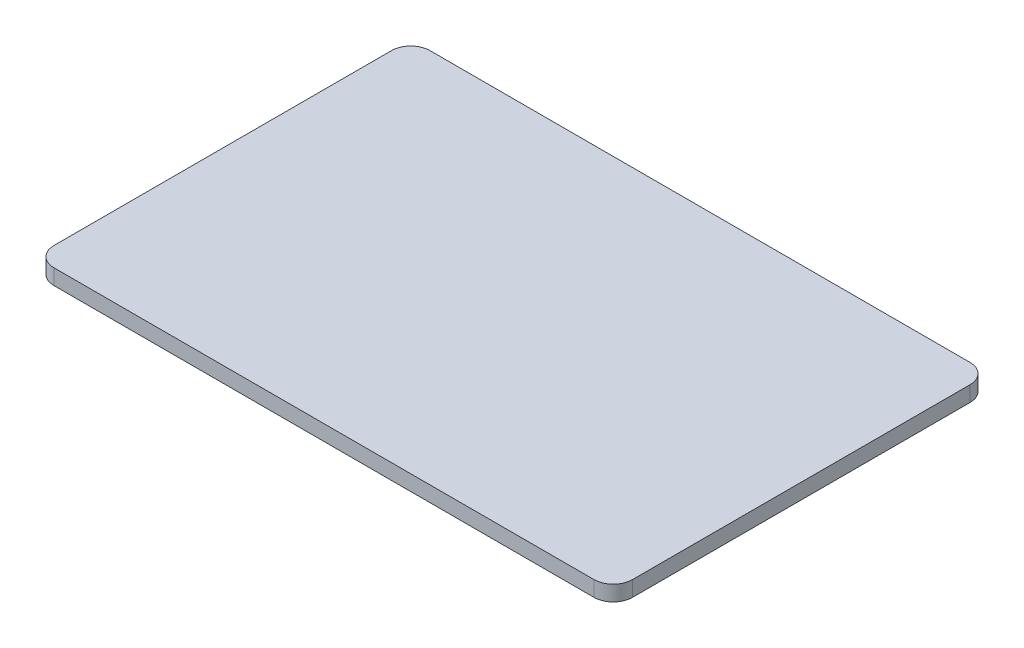
ISO-10303-21;
HEADER;
FILE_DESCRIPTION(('STEP AP214'),'2;1');
FILE_NAME('part.step','',(''),(''),'','','');
FILE_SCHEMA(('AUTOMOTIVE_DESIGN { 1 0 10303 214 1 1 1 1 }'));
ENDSEC;
DATA;
#1=APPLICATION_CONTEXT('core data for automotive mechanical design processes');
#2=APPLICATION_PROTOCOL_DEFINITION('international standard','automotive_design',2000,#1);
#3=PRODUCT_CONTEXT('',#1,'mechanical');
#4=PRODUCT('Part','Part','',(#3));
#5=PRODUCT_RELATED_PRODUCT_CATEGORY('part','',(#4));
#6=PRODUCT_DEFINITION_FORMATION('','',#4);
#7=PRODUCT_DEFINITION_CONTEXT('part definition',#1,'design');
#8=PRODUCT_DEFINITION('design','',#6,#7);
#9=PRODUCT_DEFINITION_SHAPE('','',#8);
#10=(LENGTH_UNIT() NAMED_UNIT(*) SI_UNIT(.MILLI.,.METRE.));
#11=(NAMED_UNIT(*) PLANE_ANGLE_UNIT() SI_UNIT($,.RADIAN.));
#12=(NAMED_UNIT(*) SI_UNIT($,.STERADIAN.) SOLID_ANGLE_UNIT());
#13=UNCERTAINTY_MEASURE_WITH_UNIT(LENGTH_MEASURE(1.E-05),#10,'distance_accuracy_value','');
#14=(GEOMETRIC_REPRESENTATION_CONTEXT(3) GLOBAL_UNCERTAINTY_ASSIGNED_CONTEXT((#13)) GLOBAL_UNIT_ASSIGNED_CONTEXT((#10,
#11,#12)) REPRESENTATION_CONTEXT('',''));
#15=CARTESIAN_POINT('',(0.,0.,0.));
#16=DIRECTION('',(0.,0.,1.));
#17=DIRECTION('',(1.,0.,0.));
#18=AXIS2_PLACEMENT_3D('',#15,#16,#17);
#19=CARTESIAN_POINT('',(20.,1.6,19.5));
#20=DIRECTION('',(0.,0.,-1.));
#21=DIRECTION('',(-1.,0.,0.));
#22=AXIS2_PLACEMENT_3D('',#19,#20,#21);
#23=PLANE('',#22);
#24=DIRECTION('',(1.,0.,0.));
#25=VECTOR('',#24,1.);
#26=CARTESIAN_POINT('',(20.,0.,19.5));
#27=LINE('',#26,#25);
#28=CARTESIAN_POINT('',(-38.,0.,19.5));
#29=VERTEX_POINT('',#28);
#30=CARTESIAN_POINT('',(18.,0.,19.5));
#31=VERTEX_POINT('',#30);
#32=EDGE_CURVE('E132',#29,#31,#27,.T.);
#33=ORIENTED_EDGE('',*,*,#32,.T.);
#34=DIRECTION('',(0.,-1.,0.));
#35=VECTOR('',#34,1.);
#36=CARTESIAN_POINT('',(18.,1.6,19.5));
#37=LINE('',#36,#35);
#38=CARTESIAN_POINT('',(18.,1.6,19.5));
#39=VERTEX_POINT('',#38);
#40=EDGE_CURVE('E48',#31,#39,#37,.F.);
#41=ORIENTED_EDGE('',*,*,#40,.T.);
#42=DIRECTION('',(1.,0.,0.));
#43=VECTOR('',#42,1.);
#44=CARTESIAN_POINT('',(20.,1.6,19.5));
#45=LINE('',#44,#43);
#46=CARTESIAN_POINT('',(-38.,1.6,19.5));
#47=VERTEX_POINT('',#46);
#48=EDGE_CURVE('E127',#47,#39,#45,.T.);
#49=ORIENTED_EDGE('',*,*,#48,.F.);
#50=DIRECTION('',(0.,-1.,0.));
#51=VECTOR('',#50,1.);
#52=CARTESIAN_POINT('',(-38.,1.6,19.5));
#53=LINE('',#52,#51);
#54=EDGE_CURVE('E150',#47,#29,#53,.T.);
#55=ORIENTED_EDGE('',*,*,#54,.T.);
#56=EDGE_LOOP('',(#33,#41,#49,#55));
#57=FACE_BOUND('',#56,.T.);
#58=ADVANCED_FACE('F33',(#57),#23,.F.);
#59=CARTESIAN_POINT('',(20.,1.6,19.5));
#60=DIRECTION('',(-1.,0.,0.));
#61=DIRECTION('',(0.,0.,1.));
#62=AXIS2_PLACEMENT_3D('',#59,#60,#61);
#63=PLANE('',#62);
#64=DIRECTION('',(0.,0.,-1.));
#65=VECTOR('',#64,1.);
#66=CARTESIAN_POINT('',(20.,0.,19.5));
#67=LINE('',#66,#65);
#68=CARTESIAN_POINT('',(20.,0.,17.5));
#69=VERTEX_POINT('',#68);
#70=CARTESIAN_POINT('',(20.,0.,-17.5));
#71=VERTEX_POINT('',#70);
#72=EDGE_CURVE('E128',#69,#71,#67,.T.);
#73=ORIENTED_EDGE('',*,*,#72,.T.);
#74=DIRECTION('',(0.,-1.,0.));
#75=VECTOR('',#74,1.);
#76=CARTESIAN_POINT('',(20.,1.6,-17.5));
#77=LINE('',#76,#75);
#78=CARTESIAN_POINT('',(20.,1.6,-17.5));
#79=VERTEX_POINT('',#78);
#80=EDGE_CURVE('E105',#71,#79,#77,.F.);
#81=ORIENTED_EDGE('',*,*,#80,.T.);
#82=DIRECTION('',(0.,0.,-1.));
#83=VECTOR('',#82,1.);
#84=CARTESIAN_POINT('',(20.,1.6,19.5));
#85=LINE('',#84,#83);
#86=CARTESIAN_POINT('',(20.,1.6,17.5));
#87=VERTEX_POINT('',#86);
#88=EDGE_CURVE('E130',#87,#79,#85,.T.);
#89=ORIENTED_EDGE('',*,*,#88,.F.);
#90=DIRECTION('',(0.,-1.,0.));
#91=VECTOR('',#90,1.);
#92=CARTESIAN_POINT('',(20.,1.6,17.5));
#93=LINE('',#92,#91);
#94=EDGE_CURVE('E110',#87,#69,#93,.T.);
#95=ORIENTED_EDGE('',*,*,#94,.T.);
#96=EDGE_LOOP('',(#73,#81,#89,#95));
#97=FACE_BOUND('',#96,.T.);
#98=ADVANCED_FACE('F175',(#97),#63,.F.);
#99=CARTESIAN_POINT('',(20.,1.6,-19.5));
#100=DIRECTION('',(0.,0.,1.));
#101=DIRECTION('',(1.,0.,0.));
#102=AXIS2_PLACEMENT_3D('',#99,#100,#101);
#103=PLANE('',#102);
#104=DIRECTION('',(-1.,0.,0.));
#105=VECTOR('',#104,1.);
#106=CARTESIAN_POINT('',(20.,1.6,-19.5));
#107=LINE('',#106,#105);
#108=CARTESIAN_POINT('',(18.,1.6,-19.5));
#109=VERTEX_POINT('',#108);
#110=CARTESIAN_POINT('',(-38.,1.6,-19.5));
#111=VERTEX_POINT('',#110);
#112=EDGE_CURVE('E120',#109,#111,#107,.T.);
#113=ORIENTED_EDGE('',*,*,#112,.F.);
#114=DIRECTION('',(0.,-1.,0.));
#115=VECTOR('',#114,1.);
#116=CARTESIAN_POINT('',(18.,1.6,-19.5));
#117=LINE('',#116,#115);
#118=CARTESIAN_POINT('',(18.,0.,-19.5));
#119=VERTEX_POINT('',#118);
#120=EDGE_CURVE('E104',#109,#119,#117,.T.);
#121=ORIENTED_EDGE('',*,*,#120,.T.);
#122=DIRECTION('',(-1.,0.,0.));
#123=VECTOR('',#122,1.);
#124=CARTESIAN_POINT('',(20.,0.,-19.5));
#125=LINE('',#124,#123);
#126=CARTESIAN_POINT('',(-38.,0.,-19.5));
#127=VERTEX_POINT('',#126);
#128=EDGE_CURVE('E117',#119,#127,#125,.T.);
#129=ORIENTED_EDGE('',*,*,#128,.T.);
#130=DIRECTION('',(0.,-1.,0.));
#131=VECTOR('',#130,1.);
#132=CARTESIAN_POINT('',(-38.,1.6,-19.5));
#133=LINE('',#132,#131);
#134=EDGE_CURVE('E122',#127,#111,#133,.F.);
#135=ORIENTED_EDGE('',*,*,#134,.T.);
#136=EDGE_LOOP('',(#113,#121,#129,#135));
#137=FACE_BOUND('',#136,.T.);
#138=ADVANCED_FACE('F116',(#137),#103,.F.);
#139=CARTESIAN_POINT('',(0.,1.6,0.));
#140=DIRECTION('',(0.,1.,0.));
#141=DIRECTION('',(0.,0.,1.));
#142=AXIS2_PLACEMENT_3D('',#139,#140,#141);
#143=PLANE('',#142);
#144=ORIENTED_EDGE('',*,*,#88,.T.);
#145=CARTESIAN_POINT('',(18.,1.6,-17.5));
#146=DIRECTION('',(0.,1.,0.));
#147=DIRECTION('',(0.,0.,1.));
#148=AXIS2_PLACEMENT_3D('',#145,#146,#147);
#149=CIRCLE('',#148,2.);
#150=EDGE_CURVE('E148',#79,#109,#149,.T.);
#151=ORIENTED_EDGE('',*,*,#150,.T.);
#152=ORIENTED_EDGE('',*,*,#112,.T.);
#153=CARTESIAN_POINT('',(-38.,1.6,-17.5));
#154=DIRECTION('',(0.,1.,0.));
#155=DIRECTION('',(0.,0.,1.));
#156=AXIS2_PLACEMENT_3D('',#153,#154,#155);
#157=CIRCLE('',#156,2.);
#158=CARTESIAN_POINT('',(-40.,1.6,-17.5));
#159=VERTEX_POINT('',#158);
#160=EDGE_CURVE('E144',#111,#159,#157,.T.);
#161=ORIENTED_EDGE('',*,*,#160,.T.);
#162=DIRECTION('',(0.,0.,1.));
#163=VECTOR('',#162,1.);
#164=CARTESIAN_POINT('',(-40.,1.6,-19.5));
#165=LINE('',#164,#163);
#166=CARTESIAN_POINT('',(-40.,1.6,17.5));
#167=VERTEX_POINT('',#166);
#168=EDGE_CURVE('E158',#159,#167,#165,.T.);
#169=ORIENTED_EDGE('',*,*,#168,.T.);
#170=CARTESIAN_POINT('',(-38.,1.6,17.5));
#171=DIRECTION('',(0.,1.,0.));
#172=DIRECTION('',(0.,0.,1.));
#173=AXIS2_PLACEMENT_3D('',#170,#171,#172);
#174=CIRCLE('',#173,2.);
#175=EDGE_CURVE('E55',#167,#47,#174,.T.);
#176=ORIENTED_EDGE('',*,*,#175,.T.);
#177=ORIENTED_EDGE('',*,*,#48,.T.);
#178=CARTESIAN_POINT('',(18.,1.6,17.5));
#179=DIRECTION('',(0.,1.,0.));
#180=DIRECTION('',(0.,0.,1.));
#181=AXIS2_PLACEMENT_3D('',#178,#179,#180);
#182=CIRCLE('',#181,2.);
#183=EDGE_CURVE('E146',#39,#87,#182,.T.);
#184=ORIENTED_EDGE('',*,*,#183,.T.);
#185=EDGE_LOOP('',(#144,#151,#152,#161,#169,#176,#177,#184));
#186=FACE_BOUND('',#185,.T.);
#187=ADVANCED_FACE('F163',(#186),#143,.T.);
#188=CARTESIAN_POINT('',(0.,0.,0.));
#189=DIRECTION('',(0.,1.,0.));
#190=DIRECTION('',(0.,0.,1.));
#191=AXIS2_PLACEMENT_3D('',#188,#189,#190);
#192=PLANE('',#191);
#193=ORIENTED_EDGE('',*,*,#128,.F.);
#194=CARTESIAN_POINT('',(18.,0.,-17.5));
#195=DIRECTION('',(0.,1.,0.));
#196=DIRECTION('',(0.,0.,1.));
#197=AXIS2_PLACEMENT_3D('',#194,#195,#196);
#198=CIRCLE('',#197,2.);
#199=EDGE_CURVE('E100',#119,#71,#198,.F.);
#200=ORIENTED_EDGE('',*,*,#199,.T.);
#201=ORIENTED_EDGE('',*,*,#72,.F.);
#202=CARTESIAN_POINT('',(18.,0.,17.5));
#203=DIRECTION('',(0.,1.,0.));
#204=DIRECTION('',(0.,0.,1.));
#205=AXIS2_PLACEMENT_3D('',#202,#203,#204);
#206=CIRCLE('',#205,2.);
#207=EDGE_CURVE('E111',#69,#31,#206,.F.);
#208=ORIENTED_EDGE('',*,*,#207,.T.);
#209=ORIENTED_EDGE('',*,*,#32,.F.);
#210=CARTESIAN_POINT('',(-38.,0.,17.5));
#211=DIRECTION('',(0.,1.,0.));
#212=DIRECTION('',(0.,0.,1.));
#213=AXIS2_PLACEMENT_3D('',#210,#211,#212);
#214=CIRCLE('',#213,2.);
#215=CARTESIAN_POINT('',(-40.,0.,17.5));
#216=VERTEX_POINT('',#215);
#217=EDGE_CURVE('E121',#29,#216,#214,.F.);
#218=ORIENTED_EDGE('',*,*,#217,.T.);
#219=DIRECTION('',(0.,0.,1.));
#220=VECTOR('',#219,1.);
#221=CARTESIAN_POINT('',(-40.,0.,-19.5));
#222=LINE('',#221,#220);
#223=CARTESIAN_POINT('',(-40.,0.,-17.5));
#224=VERTEX_POINT('',#223);
#225=EDGE_CURVE('E160',#224,#216,#222,.T.);
#226=ORIENTED_EDGE('',*,*,#225,.F.);
#227=CARTESIAN_POINT('',(-38.,0.,-17.5));
#228=DIRECTION('',(0.,1.,0.));
#229=DIRECTION('',(0.,0.,1.));
#230=AXIS2_PLACEMENT_3D('',#227,#228,#229);
#231=CIRCLE('',#230,2.);
#232=EDGE_CURVE('E126',#224,#127,#231,.F.);
#233=ORIENTED_EDGE('',*,*,#232,.T.);
#234=EDGE_LOOP('',(#193,#200,#201,#208,#209,#218,#226,#233));
#235=FACE_BOUND('',#234,.T.);
#236=ADVANCED_FACE('F124',(#235),#192,.F.);
#237=CARTESIAN_POINT('',(-40.,45.4292140016223,-19.5));
#238=DIRECTION('',(1.,0.,0.));
#239=DIRECTION('',(0.,0.,-1.));
#240=AXIS2_PLACEMENT_3D('',#237,#238,#239);
#241=PLANE('',#240);
#242=ORIENTED_EDGE('',*,*,#168,.F.);
#243=DIRECTION('',(0.,-1.,0.));
#244=VECTOR('',#243,1.);
#245=CARTESIAN_POINT('',(-40.,45.4292140016223,-17.5));
#246=LINE('',#245,#244);
#247=EDGE_CURVE('E11',#159,#224,#246,.T.);
#248=ORIENTED_EDGE('',*,*,#247,.T.);
#249=ORIENTED_EDGE('',*,*,#225,.T.);
#250=DIRECTION('',(0.,-1.,0.));
#251=VECTOR('',#250,1.);
#252=CARTESIAN_POINT('',(-40.,45.4292140016223,17.5));
#253=LINE('',#252,#251);
#254=EDGE_CURVE('E41',#216,#167,#253,.F.);
#255=ORIENTED_EDGE('',*,*,#254,.T.);
#256=EDGE_LOOP('',(#242,#248,#249,#255));
#257=FACE_BOUND('',#256,.T.);
#258=ADVANCED_FACE('F157',(#257),#241,.F.);
#259=CARTESIAN_POINT('',(18.,1.6,-17.5));
#260=DIRECTION('',(0.,-1.,0.));
#261=DIRECTION('',(0.,0.,-1.));
#262=AXIS2_PLACEMENT_3D('',#259,#260,#261);
#263=CYLINDRICAL_SURFACE('',#262,2.);
#264=ORIENTED_EDGE('',*,*,#150,.F.);
#265=ORIENTED_EDGE('',*,*,#80,.F.);
#266=ORIENTED_EDGE('',*,*,#199,.F.);
#267=ORIENTED_EDGE('',*,*,#120,.F.);
#268=EDGE_LOOP('',(#264,#265,#266,#267));
#269=FACE_BOUND('',#268,.T.);
#270=ADVANCED_FACE('F103',(#269),#263,.T.);
#271=CARTESIAN_POINT('',(18.,1.6,17.5));
#272=DIRECTION('',(0.,-1.,0.));
#273=DIRECTION('',(0.,0.,-1.));
#274=AXIS2_PLACEMENT_3D('',#271,#272,#273);
#275=CYLINDRICAL_SURFACE('',#274,2.);
#276=ORIENTED_EDGE('',*,*,#183,.F.);
#277=ORIENTED_EDGE('',*,*,#40,.F.);
#278=ORIENTED_EDGE('',*,*,#207,.F.);
#279=ORIENTED_EDGE('',*,*,#94,.F.);
#280=EDGE_LOOP('',(#276,#277,#278,#279));
#281=FACE_BOUND('',#280,.T.);
#282=ADVANCED_FACE('F177',(#281),#275,.T.);
#283=CARTESIAN_POINT('',(-38.,45.4292140016223,-17.5));
#284=DIRECTION('',(0.,-1.,0.));
#285=DIRECTION('',(0.,0.,-1.));
#286=AXIS2_PLACEMENT_3D('',#283,#284,#285);
#287=CYLINDRICAL_SURFACE('',#286,2.);
#288=ORIENTED_EDGE('',*,*,#160,.F.);
#289=ORIENTED_EDGE('',*,*,#134,.F.);
#290=ORIENTED_EDGE('',*,*,#232,.F.);
#291=ORIENTED_EDGE('',*,*,#247,.F.);
#292=EDGE_LOOP('',(#288,#289,#290,#291));
#293=FACE_BOUND('',#292,.T.);
#294=ADVANCED_FACE('F179',(#293),#287,.T.);
#295=CARTESIAN_POINT('',(-38.,1.6,17.5));
#296=DIRECTION('',(0.,-1.,0.));
#297=DIRECTION('',(0.,0.,-1.));
#298=AXIS2_PLACEMENT_3D('',#295,#296,#297);
#299=CYLINDRICAL_SURFACE('',#298,2.);
#300=ORIENTED_EDGE('',*,*,#175,.F.);
#301=ORIENTED_EDGE('',*,*,#254,.F.);
#302=ORIENTED_EDGE('',*,*,#217,.F.);
#303=ORIENTED_EDGE('',*,*,#54,.F.);
#304=EDGE_LOOP('',(#300,#301,#302,#303));
#305=FACE_BOUND('',#304,.T.);
#306=ADVANCED_FACE('F35',(#305),#299,.T.);
#307=CLOSED_SHELL('',(#58,#98,#138,#187,#236,#258,#270,#282,#294,#306));
#308=MANIFOLD_SOLID_BREP('B2',#307);
#309=ADVANCED_BREP_SHAPE_REPRESENTATION('',(#18,#308),#14);
#310=SHAPE_DEFINITION_REPRESENTATION(#9,#309);
ENDSEC;
END-ISO-10303-21;
